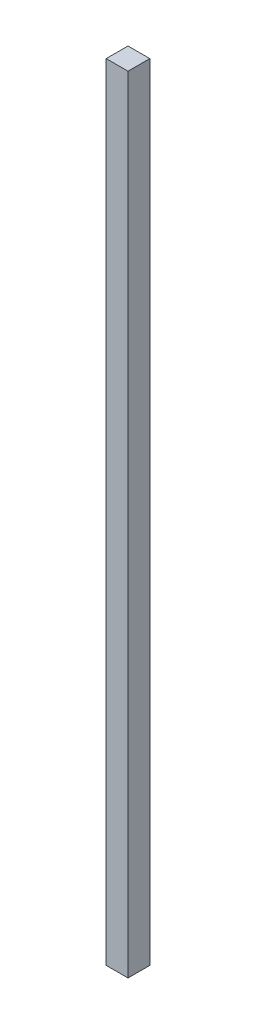
ISO-10303-21;
HEADER;
FILE_DESCRIPTION(('STEP AP214'),'2;1');
FILE_NAME('part.step','',(''),(''),'','','');
FILE_SCHEMA(('AUTOMOTIVE_DESIGN { 1 0 10303 214 1 1 1 1 }'));
ENDSEC;
DATA;
#1=APPLICATION_CONTEXT('core data for automotive mechanical design processes');
#2=APPLICATION_PROTOCOL_DEFINITION('international standard','automotive_design',2000,#1);
#3=PRODUCT_CONTEXT('',#1,'mechanical');
#4=PRODUCT('Part','Part','',(#3));
#5=PRODUCT_RELATED_PRODUCT_CATEGORY('part','',(#4));
#6=PRODUCT_DEFINITION_FORMATION('','',#4);
#7=PRODUCT_DEFINITION_CONTEXT('part definition',#1,'design');
#8=PRODUCT_DEFINITION('design','',#6,#7);
#9=PRODUCT_DEFINITION_SHAPE('','',#8);
#10=(LENGTH_UNIT() NAMED_UNIT(*) SI_UNIT(.MILLI.,.METRE.));
#11=(NAMED_UNIT(*) PLANE_ANGLE_UNIT() SI_UNIT($,.RADIAN.));
#12=(NAMED_UNIT(*) SI_UNIT($,.STERADIAN.) SOLID_ANGLE_UNIT());
#13=UNCERTAINTY_MEASURE_WITH_UNIT(LENGTH_MEASURE(1.E-05),#10,'distance_accuracy_value','');
#14=(GEOMETRIC_REPRESENTATION_CONTEXT(3) GLOBAL_UNCERTAINTY_ASSIGNED_CONTEXT((#13)) GLOBAL_UNIT_ASSIGNED_CONTEXT((#10,
#11,#12)) REPRESENTATION_CONTEXT('',''));
#15=CARTESIAN_POINT('',(0.,0.,0.));
#16=DIRECTION('',(0.,0.,1.));
#17=DIRECTION('',(1.,0.,0.));
#18=AXIS2_PLACEMENT_3D('',#15,#16,#17);
#19=CARTESIAN_POINT('',(1.5875,-57.16016,3.175));
#20=DIRECTION('',(-1.,0.,0.));
#21=DIRECTION('',(0.,0.,1.));
#22=AXIS2_PLACEMENT_3D('',#19,#20,#21);
#23=PLANE('',#22);
#24=DIRECTION('',(0.,1.,0.));
#25=VECTOR('',#24,1.);
#26=CARTESIAN_POINT('',(1.5875,-57.16016,0.));
#27=LINE('',#26,#25);
#28=CARTESIAN_POINT('',(1.5875,-57.16016,0.));
#29=VERTEX_POINT('',#28);
#30=CARTESIAN_POINT('',(1.5875,57.16016,0.));
#31=VERTEX_POINT('',#30);
#32=EDGE_CURVE('E112',#29,#31,#27,.T.);
#33=ORIENTED_EDGE('',*,*,#32,.T.);
#34=DIRECTION('',(0.,0.,-1.));
#35=VECTOR('',#34,1.);
#36=CARTESIAN_POINT('',(1.5875,57.16016,3.175));
#37=LINE('',#36,#35);
#38=CARTESIAN_POINT('',(1.5875,57.16016,3.175));
#39=VERTEX_POINT('',#38);
#40=EDGE_CURVE('E11',#39,#31,#37,.T.);
#41=ORIENTED_EDGE('',*,*,#40,.F.);
#42=DIRECTION('',(0.,1.,0.));
#43=VECTOR('',#42,1.);
#44=CARTESIAN_POINT('',(1.5875,-57.16016,3.175));
#45=LINE('',#44,#43);
#46=CARTESIAN_POINT('',(1.5875,-57.16016,3.175));
#47=VERTEX_POINT('',#46);
#48=EDGE_CURVE('E96',#47,#39,#45,.T.);
#49=ORIENTED_EDGE('',*,*,#48,.F.);
#50=DIRECTION('',(0.,0.,-1.));
#51=VECTOR('',#50,1.);
#52=CARTESIAN_POINT('',(1.5875,-57.16016,3.175));
#53=LINE('',#52,#51);
#54=EDGE_CURVE('E108',#47,#29,#53,.T.);
#55=ORIENTED_EDGE('',*,*,#54,.T.);
#56=EDGE_LOOP('',(#33,#41,#49,#55));
#57=FACE_BOUND('',#56,.T.);
#58=ADVANCED_FACE('F44',(#57),#23,.F.);
#59=CARTESIAN_POINT('',(-1.5875,57.16016,3.175));
#60=DIRECTION('',(0.,-1.,0.));
#61=DIRECTION('',(0.,0.,-1.));
#62=AXIS2_PLACEMENT_3D('',#59,#60,#61);
#63=PLANE('',#62);
#64=DIRECTION('',(-1.,0.,0.));
#65=VECTOR('',#64,1.);
#66=CARTESIAN_POINT('',(-1.5875,57.16016,0.));
#67=LINE('',#66,#65);
#68=CARTESIAN_POINT('',(-1.5875,57.16016,0.));
#69=VERTEX_POINT('',#68);
#70=EDGE_CURVE('E101',#31,#69,#67,.T.);
#71=ORIENTED_EDGE('',*,*,#70,.T.);
#72=DIRECTION('',(0.,0.,-1.));
#73=VECTOR('',#72,1.);
#74=CARTESIAN_POINT('',(-1.5875,57.16016,3.175));
#75=LINE('',#74,#73);
#76=CARTESIAN_POINT('',(-1.5875,57.16016,3.175));
#77=VERTEX_POINT('',#76);
#78=EDGE_CURVE('E53',#77,#69,#75,.T.);
#79=ORIENTED_EDGE('',*,*,#78,.F.);
#80=DIRECTION('',(-1.,0.,0.));
#81=VECTOR('',#80,1.);
#82=CARTESIAN_POINT('',(-1.5875,57.16016,3.175));
#83=LINE('',#82,#81);
#84=EDGE_CURVE('E91',#39,#77,#83,.T.);
#85=ORIENTED_EDGE('',*,*,#84,.F.);
#86=ORIENTED_EDGE('',*,*,#40,.T.);
#87=EDGE_LOOP('',(#71,#79,#85,#86));
#88=FACE_BOUND('',#87,.T.);
#89=ADVANCED_FACE('F100',(#88),#63,.F.);
#90=CARTESIAN_POINT('',(-1.5875,-57.16016,3.175));
#91=DIRECTION('',(1.,0.,0.));
#92=DIRECTION('',(0.,0.,-1.));
#93=AXIS2_PLACEMENT_3D('',#90,#91,#92);
#94=PLANE('',#93);
#95=DIRECTION('',(0.,-1.,0.));
#96=VECTOR('',#95,1.);
#97=CARTESIAN_POINT('',(-1.5875,-57.16016,0.));
#98=LINE('',#97,#96);
#99=CARTESIAN_POINT('',(-1.5875,-57.16016,0.));
#100=VERTEX_POINT('',#99);
#101=EDGE_CURVE('E78',#69,#100,#98,.T.);
#102=ORIENTED_EDGE('',*,*,#101,.T.);
#103=DIRECTION('',(0.,0.,-1.));
#104=VECTOR('',#103,1.);
#105=CARTESIAN_POINT('',(-1.5875,-57.16016,3.175));
#106=LINE('',#105,#104);
#107=CARTESIAN_POINT('',(-1.5875,-57.16016,3.175));
#108=VERTEX_POINT('',#107);
#109=EDGE_CURVE('E103',#108,#100,#106,.T.);
#110=ORIENTED_EDGE('',*,*,#109,.F.);
#111=DIRECTION('',(0.,-1.,0.));
#112=VECTOR('',#111,1.);
#113=CARTESIAN_POINT('',(-1.5875,-57.16016,3.175));
#114=LINE('',#113,#112);
#115=EDGE_CURVE('E94',#77,#108,#114,.T.);
#116=ORIENTED_EDGE('',*,*,#115,.F.);
#117=ORIENTED_EDGE('',*,*,#78,.T.);
#118=EDGE_LOOP('',(#102,#110,#116,#117));
#119=FACE_BOUND('',#118,.T.);
#120=ADVANCED_FACE('F104',(#119),#94,.F.);
#121=CARTESIAN_POINT('',(-1.5875,-57.16016,3.175));
#122=DIRECTION('',(0.,1.,0.));
#123=DIRECTION('',(0.,0.,1.));
#124=AXIS2_PLACEMENT_3D('',#121,#122,#123);
#125=PLANE('',#124);
#126=DIRECTION('',(1.,0.,0.));
#127=VECTOR('',#126,1.);
#128=CARTESIAN_POINT('',(-1.5875,-57.16016,0.));
#129=LINE('',#128,#127);
#130=EDGE_CURVE('E84',#100,#29,#129,.T.);
#131=ORIENTED_EDGE('',*,*,#130,.T.);
#132=ORIENTED_EDGE('',*,*,#54,.F.);
#133=DIRECTION('',(1.,0.,0.));
#134=VECTOR('',#133,1.);
#135=CARTESIAN_POINT('',(-1.5875,-57.16016,3.175));
#136=LINE('',#135,#134);
#137=EDGE_CURVE('E61',#108,#47,#136,.T.);
#138=ORIENTED_EDGE('',*,*,#137,.F.);
#139=ORIENTED_EDGE('',*,*,#109,.T.);
#140=EDGE_LOOP('',(#131,#132,#138,#139));
#141=FACE_BOUND('',#140,.T.);
#142=ADVANCED_FACE('F125',(#141),#125,.F.);
#143=CARTESIAN_POINT('',(0.,0.,3.175));
#144=DIRECTION('',(0.,0.,-1.));
#145=DIRECTION('',(-1.,0.,0.));
#146=AXIS2_PLACEMENT_3D('',#143,#144,#145);
#147=PLANE('',#146);
#148=ORIENTED_EDGE('',*,*,#48,.T.);
#149=ORIENTED_EDGE('',*,*,#84,.T.);
#150=ORIENTED_EDGE('',*,*,#115,.T.);
#151=ORIENTED_EDGE('',*,*,#137,.T.);
#152=EDGE_LOOP('',(#148,#149,#150,#151));
#153=FACE_BOUND('',#152,.T.);
#154=ADVANCED_FACE('F92',(#153),#147,.F.);
#155=CARTESIAN_POINT('',(0.,0.,0.));
#156=DIRECTION('',(0.,0.,-1.));
#157=DIRECTION('',(-1.,0.,0.));
#158=AXIS2_PLACEMENT_3D('',#155,#156,#157);
#159=PLANE('',#158);
#160=ORIENTED_EDGE('',*,*,#32,.F.);
#161=ORIENTED_EDGE('',*,*,#130,.F.);
#162=ORIENTED_EDGE('',*,*,#101,.F.);
#163=ORIENTED_EDGE('',*,*,#70,.F.);
#164=EDGE_LOOP('',(#160,#161,#162,#163));
#165=FACE_BOUND('',#164,.T.);
#166=ADVANCED_FACE('F128',(#165),#159,.T.);
#167=CLOSED_SHELL('',(#58,#89,#120,#142,#154,#166));
#168=MANIFOLD_SOLID_BREP('B2',#167);
#169=ADVANCED_BREP_SHAPE_REPRESENTATION('',(#18,#168),#14);
#170=SHAPE_DEFINITION_REPRESENTATION(#9,#169);
ENDSEC;
END-ISO-10303-21;
